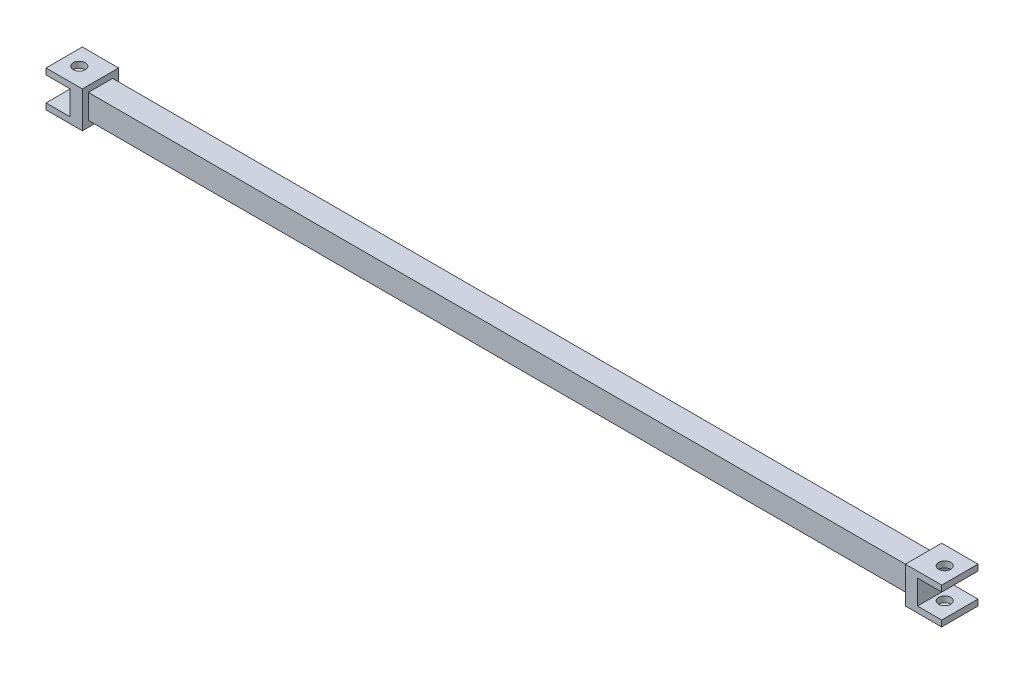
ISO-10303-21;
HEADER;
FILE_DESCRIPTION(('STEP AP214'),'2;1');
FILE_NAME('part.step','',(''),(''),'','','');
FILE_SCHEMA(('AUTOMOTIVE_DESIGN { 1 0 10303 214 1 1 1 1 }'));
ENDSEC;
DATA;
#1=APPLICATION_CONTEXT('core data for automotive mechanical design processes');
#2=APPLICATION_PROTOCOL_DEFINITION('international standard','automotive_design',2000,#1);
#3=PRODUCT_CONTEXT('',#1,'mechanical');
#4=PRODUCT('Part','Part','',(#3));
#5=PRODUCT_RELATED_PRODUCT_CATEGORY('part','',(#4));
#6=PRODUCT_DEFINITION_FORMATION('','',#4);
#7=PRODUCT_DEFINITION_CONTEXT('part definition',#1,'design');
#8=PRODUCT_DEFINITION('design','',#6,#7);
#9=PRODUCT_DEFINITION_SHAPE('','',#8);
#10=(LENGTH_UNIT() NAMED_UNIT(*) SI_UNIT(.MILLI.,.METRE.));
#11=(NAMED_UNIT(*) PLANE_ANGLE_UNIT() SI_UNIT($,.RADIAN.));
#12=(NAMED_UNIT(*) SI_UNIT($,.STERADIAN.) SOLID_ANGLE_UNIT());
#13=UNCERTAINTY_MEASURE_WITH_UNIT(LENGTH_MEASURE(1.E-05),#10,'distance_accuracy_value','');
#14=(GEOMETRIC_REPRESENTATION_CONTEXT(3) GLOBAL_UNCERTAINTY_ASSIGNED_CONTEXT((#13)) GLOBAL_UNIT_ASSIGNED_CONTEXT((#10,
#11,#12)) REPRESENTATION_CONTEXT('',''));
#15=CARTESIAN_POINT('',(0.,0.,0.));
#16=DIRECTION('',(0.,0.,1.));
#17=DIRECTION('',(1.,0.,0.));
#18=AXIS2_PLACEMENT_3D('',#15,#16,#17);
#19=CARTESIAN_POINT('',(37.,-1.5,-0.5));
#20=DIRECTION('',(0.,0.,-1.));
#21=DIRECTION('',(-1.,0.,0.));
#22=AXIS2_PLACEMENT_3D('',#19,#20,#21);
#23=PLANE('',#22);
#24=DIRECTION('',(0.,-1.,0.));
#25=VECTOR('',#24,1.);
#26=CARTESIAN_POINT('',(35.,-1.5,-0.5));
#27=LINE('',#26,#25);
#28=CARTESIAN_POINT('',(35.,0.999999999999999,-0.5));
#29=VERTEX_POINT('',#28);
#30=CARTESIAN_POINT('',(35.,-1.,-0.5));
#31=VERTEX_POINT('',#30);
#32=EDGE_CURVE('E220',#29,#31,#27,.T.);
#33=ORIENTED_EDGE('',*,*,#32,.T.);
#34=DIRECTION('',(1.,0.,0.));
#35=VECTOR('',#34,1.);
#36=CARTESIAN_POINT('',(37.,-1.,-0.5));
#37=LINE('',#36,#35);
#38=CARTESIAN_POINT('',(37.,-1.,-0.5));
#39=VERTEX_POINT('',#38);
#40=EDGE_CURVE('E411',#31,#39,#37,.T.);
#41=ORIENTED_EDGE('',*,*,#40,.T.);
#42=DIRECTION('',(0.,-1.,0.));
#43=VECTOR('',#42,1.);
#44=CARTESIAN_POINT('',(37.,-1.5,-0.5));
#45=LINE('',#44,#43);
#46=CARTESIAN_POINT('',(37.,-1.5,-0.5));
#47=VERTEX_POINT('',#46);
#48=EDGE_CURVE('E232',#39,#47,#45,.T.);
#49=ORIENTED_EDGE('',*,*,#48,.T.);
#50=DIRECTION('',(-1.,0.,0.));
#51=VECTOR('',#50,1.);
#52=CARTESIAN_POINT('',(37.,-1.5,-0.5));
#53=LINE('',#52,#51);
#54=CARTESIAN_POINT('',(34.,-1.5,-0.5));
#55=VERTEX_POINT('',#54);
#56=EDGE_CURVE('E214',#47,#55,#53,.T.);
#57=ORIENTED_EDGE('',*,*,#56,.T.);
#58=DIRECTION('',(0.,-1.,0.));
#59=VECTOR('',#58,1.);
#60=CARTESIAN_POINT('',(34.,-1.5,-0.5));
#61=LINE('',#60,#59);
#62=CARTESIAN_POINT('',(34.,1.5,-0.5));
#63=VERTEX_POINT('',#62);
#64=EDGE_CURVE('E215',#63,#55,#61,.T.);
#65=ORIENTED_EDGE('',*,*,#64,.F.);
#66=DIRECTION('',(-1.,0.,0.));
#67=VECTOR('',#66,1.);
#68=CARTESIAN_POINT('',(37.,1.5,-0.5));
#69=LINE('',#68,#67);
#70=CARTESIAN_POINT('',(37.,1.5,-0.5));
#71=VERTEX_POINT('',#70);
#72=EDGE_CURVE('E241',#71,#63,#69,.T.);
#73=ORIENTED_EDGE('',*,*,#72,.F.);
#74=CARTESIAN_POINT('',(37.,1.,-0.5));
#75=VERTEX_POINT('',#74);
#76=EDGE_CURVE('E207',#71,#75,#45,.T.);
#77=ORIENTED_EDGE('',*,*,#76,.T.);
#78=DIRECTION('',(-1.,0.,0.));
#79=VECTOR('',#78,1.);
#80=CARTESIAN_POINT('',(37.,0.999999999999999,-0.5));
#81=LINE('',#80,#79);
#82=EDGE_CURVE('E55',#75,#29,#81,.T.);
#83=ORIENTED_EDGE('',*,*,#82,.T.);
#84=EDGE_LOOP('',(#33,#41,#49,#57,#65,#73,#77,#83));
#85=FACE_BOUND('',#84,.T.);
#86=ADVANCED_FACE('F38',(#85),#23,.T.);
#87=CARTESIAN_POINT('',(37.,-1.5,2.5));
#88=DIRECTION('',(0.,0.,1.));
#89=DIRECTION('',(1.,0.,0.));
#90=AXIS2_PLACEMENT_3D('',#87,#88,#89);
#91=PLANE('',#90);
#92=DIRECTION('',(0.,1.,0.));
#93=VECTOR('',#92,1.);
#94=CARTESIAN_POINT('',(37.,-1.5,2.5));
#95=LINE('',#94,#93);
#96=CARTESIAN_POINT('',(37.,-1.5,2.5));
#97=VERTEX_POINT('',#96);
#98=CARTESIAN_POINT('',(37.,-1.,2.5));
#99=VERTEX_POINT('',#98);
#100=EDGE_CURVE('E202',#97,#99,#95,.T.);
#101=ORIENTED_EDGE('',*,*,#100,.T.);
#102=DIRECTION('',(-1.,0.,0.));
#103=VECTOR('',#102,1.);
#104=CARTESIAN_POINT('',(37.,-1.,2.5));
#105=LINE('',#104,#103);
#106=CARTESIAN_POINT('',(35.,-1.,2.5));
#107=VERTEX_POINT('',#106);
#108=EDGE_CURVE('E391',#99,#107,#105,.T.);
#109=ORIENTED_EDGE('',*,*,#108,.T.);
#110=DIRECTION('',(0.,1.,0.));
#111=VECTOR('',#110,1.);
#112=CARTESIAN_POINT('',(35.,-1.5,2.5));
#113=LINE('',#112,#111);
#114=CARTESIAN_POINT('',(35.,1.,2.5));
#115=VERTEX_POINT('',#114);
#116=EDGE_CURVE('E11',#107,#115,#113,.T.);
#117=ORIENTED_EDGE('',*,*,#116,.T.);
#118=DIRECTION('',(1.,0.,0.));
#119=VECTOR('',#118,1.);
#120=CARTESIAN_POINT('',(37.,1.,2.5));
#121=LINE('',#120,#119);
#122=CARTESIAN_POINT('',(37.,1.,2.5));
#123=VERTEX_POINT('',#122);
#124=EDGE_CURVE('E179',#115,#123,#121,.T.);
#125=ORIENTED_EDGE('',*,*,#124,.T.);
#126=CARTESIAN_POINT('',(37.,1.5,2.5));
#127=VERTEX_POINT('',#126);
#128=EDGE_CURVE('E191',#123,#127,#95,.T.);
#129=ORIENTED_EDGE('',*,*,#128,.T.);
#130=DIRECTION('',(-1.,0.,0.));
#131=VECTOR('',#130,1.);
#132=CARTESIAN_POINT('',(37.,1.5,2.5));
#133=LINE('',#132,#131);
#134=CARTESIAN_POINT('',(34.,1.5,2.5));
#135=VERTEX_POINT('',#134);
#136=EDGE_CURVE('E238',#127,#135,#133,.T.);
#137=ORIENTED_EDGE('',*,*,#136,.T.);
#138=DIRECTION('',(0.,1.,0.));
#139=VECTOR('',#138,1.);
#140=CARTESIAN_POINT('',(34.,-1.5,2.5));
#141=LINE('',#140,#139);
#142=CARTESIAN_POINT('',(34.,-1.5,2.5));
#143=VERTEX_POINT('',#142);
#144=EDGE_CURVE('E224',#143,#135,#141,.T.);
#145=ORIENTED_EDGE('',*,*,#144,.F.);
#146=DIRECTION('',(-1.,0.,0.));
#147=VECTOR('',#146,1.);
#148=CARTESIAN_POINT('',(37.,-1.5,2.5));
#149=LINE('',#148,#147);
#150=EDGE_CURVE('E235',#97,#143,#149,.T.);
#151=ORIENTED_EDGE('',*,*,#150,.F.);
#152=EDGE_LOOP('',(#101,#109,#117,#125,#129,#137,#145,#151));
#153=FACE_BOUND('',#152,.T.);
#154=ADVANCED_FACE('F190',(#153),#91,.T.);
#155=CARTESIAN_POINT('',(37.,0.,0.));
#156=DIRECTION('',(1.,0.,0.));
#157=DIRECTION('',(0.,0.,1.));
#158=AXIS2_PLACEMENT_3D('',#155,#156,#157);
#159=PLANE('',#158);
#160=ORIENTED_EDGE('',*,*,#48,.F.);
#161=DIRECTION('',(0.,0.,1.));
#162=VECTOR('',#161,1.);
#163=CARTESIAN_POINT('',(37.,-1.,0.));
#164=LINE('',#163,#162);
#165=EDGE_CURVE('E48',#39,#99,#164,.T.);
#166=ORIENTED_EDGE('',*,*,#165,.T.);
#167=ORIENTED_EDGE('',*,*,#100,.F.);
#168=DIRECTION('',(0.,0.,1.));
#169=VECTOR('',#168,1.);
#170=CARTESIAN_POINT('',(37.,-1.5,2.5));
#171=LINE('',#170,#169);
#172=EDGE_CURVE('E206',#47,#97,#171,.T.);
#173=ORIENTED_EDGE('',*,*,#172,.F.);
#174=EDGE_LOOP('',(#160,#166,#167,#173));
#175=FACE_BOUND('',#174,.T.);
#176=ADVANCED_FACE('F387',(#175),#159,.T.);
#177=ORIENTED_EDGE('',*,*,#128,.F.);
#178=DIRECTION('',(0.,0.,-1.));
#179=VECTOR('',#178,1.);
#180=CARTESIAN_POINT('',(37.,0.999999999999999,0.));
#181=LINE('',#180,#179);
#182=EDGE_CURVE('E176',#123,#75,#181,.T.);
#183=ORIENTED_EDGE('',*,*,#182,.T.);
#184=ORIENTED_EDGE('',*,*,#76,.F.);
#185=DIRECTION('',(0.,0.,-1.));
#186=VECTOR('',#185,1.);
#187=CARTESIAN_POINT('',(37.,1.5,2.5));
#188=LINE('',#187,#186);
#189=EDGE_CURVE('E200',#127,#71,#188,.T.);
#190=ORIENTED_EDGE('',*,*,#189,.F.);
#191=EDGE_LOOP('',(#177,#183,#184,#190));
#192=FACE_BOUND('',#191,.T.);
#193=ADVANCED_FACE('F198',(#192),#159,.T.);
#194=CARTESIAN_POINT('',(-37.,0.,0.));
#195=DIRECTION('',(-1.,0.,0.));
#196=DIRECTION('',(0.,0.,1.));
#197=AXIS2_PLACEMENT_3D('',#194,#195,#196);
#198=PLANE('',#197);
#199=DIRECTION('',(0.,0.,-1.));
#200=VECTOR('',#199,1.);
#201=CARTESIAN_POINT('',(-37.,0.999999999999999,0.));
#202=LINE('',#201,#200);
#203=CARTESIAN_POINT('',(-37.,1.,2.5));
#204=VERTEX_POINT('',#203);
#205=CARTESIAN_POINT('',(-37.,0.999999999999999,-0.5));
#206=VERTEX_POINT('',#205);
#207=EDGE_CURVE('E374',#204,#206,#202,.T.);
#208=ORIENTED_EDGE('',*,*,#207,.F.);
#209=DIRECTION('',(0.,1.,0.));
#210=VECTOR('',#209,1.);
#211=CARTESIAN_POINT('',(-37.,-1.5,2.5));
#212=LINE('',#211,#210);
#213=CARTESIAN_POINT('',(-37.,1.5,2.5));
#214=VERTEX_POINT('',#213);
#215=EDGE_CURVE('E291',#204,#214,#212,.T.);
#216=ORIENTED_EDGE('',*,*,#215,.T.);
#217=DIRECTION('',(0.,0.,-1.));
#218=VECTOR('',#217,1.);
#219=CARTESIAN_POINT('',(-37.,1.5,2.5));
#220=LINE('',#219,#218);
#221=CARTESIAN_POINT('',(-37.,1.5,-0.5));
#222=VERTEX_POINT('',#221);
#223=EDGE_CURVE('E296',#214,#222,#220,.T.);
#224=ORIENTED_EDGE('',*,*,#223,.T.);
#225=DIRECTION('',(0.,-1.,0.));
#226=VECTOR('',#225,1.);
#227=CARTESIAN_POINT('',(-37.,-1.5,-0.5));
#228=LINE('',#227,#226);
#229=EDGE_CURVE('E283',#222,#206,#228,.T.);
#230=ORIENTED_EDGE('',*,*,#229,.T.);
#231=EDGE_LOOP('',(#208,#216,#224,#230));
#232=FACE_BOUND('',#231,.T.);
#233=ADVANCED_FACE('F486',(#232),#198,.T.);
#234=CARTESIAN_POINT('',(-34.,1.,2.));
#235=DIRECTION('',(0.,-1.,0.));
#236=DIRECTION('',(0.,0.,-1.));
#237=AXIS2_PLACEMENT_3D('',#234,#235,#236);
#238=PLANE('',#237);
#239=DIRECTION('',(-1.,0.,0.));
#240=VECTOR('',#239,1.);
#241=CARTESIAN_POINT('',(-34.,1.,0.));
#242=LINE('',#241,#240);
#243=CARTESIAN_POINT('',(34.,1.,0.));
#244=VERTEX_POINT('',#243);
#245=CARTESIAN_POINT('',(-34.,1.,0.));
#246=VERTEX_POINT('',#245);
#247=EDGE_CURVE('E346',#244,#246,#242,.T.);
#248=ORIENTED_EDGE('',*,*,#247,.T.);
#249=DIRECTION('',(0.,0.,-1.));
#250=VECTOR('',#249,1.);
#251=CARTESIAN_POINT('',(-34.,1.,2.));
#252=LINE('',#251,#250);
#253=CARTESIAN_POINT('',(-34.,1.,2.));
#254=VERTEX_POINT('',#253);
#255=EDGE_CURVE('E363',#254,#246,#252,.T.);
#256=ORIENTED_EDGE('',*,*,#255,.F.);
#257=DIRECTION('',(-1.,0.,0.));
#258=VECTOR('',#257,1.);
#259=CARTESIAN_POINT('',(-34.,1.,2.));
#260=LINE('',#259,#258);
#261=CARTESIAN_POINT('',(34.,1.,2.));
#262=VERTEX_POINT('',#261);
#263=EDGE_CURVE('E332',#262,#254,#260,.T.);
#264=ORIENTED_EDGE('',*,*,#263,.F.);
#265=DIRECTION('',(0.,0.,-1.));
#266=VECTOR('',#265,1.);
#267=CARTESIAN_POINT('',(34.,1.,2.));
#268=LINE('',#267,#266);
#269=EDGE_CURVE('E367',#262,#244,#268,.T.);
#270=ORIENTED_EDGE('',*,*,#269,.T.);
#271=EDGE_LOOP('',(#248,#256,#264,#270));
#272=FACE_BOUND('',#271,.T.);
#273=ADVANCED_FACE('F40',(#272),#238,.F.);
#274=CARTESIAN_POINT('',(-34.,-1.,2.));
#275=DIRECTION('',(0.,1.,0.));
#276=DIRECTION('',(0.,0.,1.));
#277=AXIS2_PLACEMENT_3D('',#274,#275,#276);
#278=PLANE('',#277);
#279=DIRECTION('',(1.,0.,0.));
#280=VECTOR('',#279,1.);
#281=CARTESIAN_POINT('',(-34.,-1.,0.));
#282=LINE('',#281,#280);
#283=CARTESIAN_POINT('',(-34.,-1.,0.));
#284=VERTEX_POINT('',#283);
#285=CARTESIAN_POINT('',(34.,-1.,0.));
#286=VERTEX_POINT('',#285);
#287=EDGE_CURVE('E333',#284,#286,#282,.T.);
#288=ORIENTED_EDGE('',*,*,#287,.T.);
#289=DIRECTION('',(0.,0.,-1.));
#290=VECTOR('',#289,1.);
#291=CARTESIAN_POINT('',(34.,-1.,2.));
#292=LINE('',#291,#290);
#293=CARTESIAN_POINT('',(34.,-1.,2.));
#294=VERTEX_POINT('',#293);
#295=EDGE_CURVE('E342',#294,#286,#292,.T.);
#296=ORIENTED_EDGE('',*,*,#295,.F.);
#297=DIRECTION('',(1.,0.,0.));
#298=VECTOR('',#297,1.);
#299=CARTESIAN_POINT('',(-34.,-1.,2.));
#300=LINE('',#299,#298);
#301=CARTESIAN_POINT('',(-34.,-1.,2.));
#302=VERTEX_POINT('',#301);
#303=EDGE_CURVE('E339',#302,#294,#300,.T.);
#304=ORIENTED_EDGE('',*,*,#303,.F.);
#305=DIRECTION('',(0.,0.,-1.));
#306=VECTOR('',#305,1.);
#307=CARTESIAN_POINT('',(-34.,-1.,2.));
#308=LINE('',#307,#306);
#309=EDGE_CURVE('E360',#302,#284,#308,.T.);
#310=ORIENTED_EDGE('',*,*,#309,.T.);
#311=EDGE_LOOP('',(#288,#296,#304,#310));
#312=FACE_BOUND('',#311,.T.);
#313=ADVANCED_FACE('F510',(#312),#278,.F.);
#314=CARTESIAN_POINT('',(0.,0.,2.));
#315=DIRECTION('',(0.,0.,1.));
#316=DIRECTION('',(1.,0.,0.));
#317=AXIS2_PLACEMENT_3D('',#314,#315,#316);
#318=PLANE('',#317);
#319=DIRECTION('',(0.,1.,0.));
#320=VECTOR('',#319,1.);
#321=CARTESIAN_POINT('',(34.,1.,2.));
#322=LINE('',#321,#320);
#323=EDGE_CURVE('E328',#294,#262,#322,.T.);
#324=ORIENTED_EDGE('',*,*,#323,.T.);
#325=ORIENTED_EDGE('',*,*,#263,.T.);
#326=DIRECTION('',(0.,-1.,0.));
#327=VECTOR('',#326,1.);
#328=CARTESIAN_POINT('',(-34.,1.,2.));
#329=LINE('',#328,#327);
#330=EDGE_CURVE('E336',#254,#302,#329,.T.);
#331=ORIENTED_EDGE('',*,*,#330,.T.);
#332=ORIENTED_EDGE('',*,*,#303,.T.);
#333=EDGE_LOOP('',(#324,#325,#331,#332));
#334=FACE_BOUND('',#333,.T.);
#335=ADVANCED_FACE('F507',(#334),#318,.T.);
#336=CARTESIAN_POINT('',(0.,0.,0.));
#337=DIRECTION('',(0.,0.,1.));
#338=DIRECTION('',(1.,0.,0.));
#339=AXIS2_PLACEMENT_3D('',#336,#337,#338);
#340=PLANE('',#339);
#341=DIRECTION('',(0.,1.,0.));
#342=VECTOR('',#341,1.);
#343=CARTESIAN_POINT('',(34.,1.,0.));
#344=LINE('',#343,#342);
#345=EDGE_CURVE('E327',#286,#244,#344,.T.);
#346=ORIENTED_EDGE('',*,*,#345,.F.);
#347=ORIENTED_EDGE('',*,*,#287,.F.);
#348=DIRECTION('',(0.,-1.,0.));
#349=VECTOR('',#348,1.);
#350=CARTESIAN_POINT('',(-34.,1.,0.));
#351=LINE('',#350,#349);
#352=EDGE_CURVE('E350',#246,#284,#351,.T.);
#353=ORIENTED_EDGE('',*,*,#352,.F.);
#354=ORIENTED_EDGE('',*,*,#247,.F.);
#355=EDGE_LOOP('',(#346,#347,#353,#354));
#356=FACE_BOUND('',#355,.T.);
#357=ADVANCED_FACE('F491',(#356),#340,.F.);
#358=CARTESIAN_POINT('',(-34.,0.,0.));
#359=DIRECTION('',(-1.,0.,0.));
#360=DIRECTION('',(0.,0.,1.));
#361=AXIS2_PLACEMENT_3D('',#358,#359,#360);
#362=PLANE('',#361);
#363=DIRECTION('',(0.,-1.,0.));
#364=VECTOR('',#363,1.);
#365=CARTESIAN_POINT('',(-34.,-1.5,-0.5));
#366=LINE('',#365,#364);
#367=CARTESIAN_POINT('',(-34.,1.5,-0.5));
#368=VERTEX_POINT('',#367);
#369=CARTESIAN_POINT('',(-34.,-1.5,-0.5));
#370=VERTEX_POINT('',#369);
#371=EDGE_CURVE('E282',#368,#370,#366,.T.);
#372=ORIENTED_EDGE('',*,*,#371,.F.);
#373=DIRECTION('',(0.,0.,-1.));
#374=VECTOR('',#373,1.);
#375=CARTESIAN_POINT('',(-34.,1.5,2.5));
#376=LINE('',#375,#374);
#377=CARTESIAN_POINT('',(-34.,1.5,2.5));
#378=VERTEX_POINT('',#377);
#379=EDGE_CURVE('E309',#378,#368,#376,.T.);
#380=ORIENTED_EDGE('',*,*,#379,.F.);
#381=DIRECTION('',(0.,1.,0.));
#382=VECTOR('',#381,1.);
#383=CARTESIAN_POINT('',(-34.,-1.5,2.5));
#384=LINE('',#383,#382);
#385=CARTESIAN_POINT('',(-34.,-1.5,2.5));
#386=VERTEX_POINT('',#385);
#387=EDGE_CURVE('E306',#386,#378,#384,.T.);
#388=ORIENTED_EDGE('',*,*,#387,.F.);
#389=DIRECTION('',(0.,0.,1.));
#390=VECTOR('',#389,1.);
#391=CARTESIAN_POINT('',(-34.,-1.5,2.5));
#392=LINE('',#391,#390);
#393=EDGE_CURVE('E303',#370,#386,#392,.T.);
#394=ORIENTED_EDGE('',*,*,#393,.F.);
#395=EDGE_LOOP('',(#372,#380,#388,#394));
#396=FACE_BOUND('',#395,.T.);
#397=ORIENTED_EDGE('',*,*,#255,.T.);
#398=ORIENTED_EDGE('',*,*,#352,.T.);
#399=ORIENTED_EDGE('',*,*,#309,.F.);
#400=ORIENTED_EDGE('',*,*,#330,.F.);
#401=EDGE_LOOP('',(#397,#398,#399,#400));
#402=FACE_BOUND('',#401,.T.);
#403=ADVANCED_FACE('F487',(#396,#402),#362,.F.);
#404=CARTESIAN_POINT('',(-37.,-1.5,-0.5));
#405=DIRECTION('',(0.,0.,1.));
#406=DIRECTION('',(1.,0.,0.));
#407=AXIS2_PLACEMENT_3D('',#404,#405,#406);
#408=PLANE('',#407);
#409=DIRECTION('',(0.,-1.,0.));
#410=VECTOR('',#409,1.);
#411=CARTESIAN_POINT('',(-35.,-1.5,-0.5));
#412=LINE('',#411,#410);
#413=CARTESIAN_POINT('',(-35.,0.999999999999999,-0.5));
#414=VERTEX_POINT('',#413);
#415=CARTESIAN_POINT('',(-35.,-1.,-0.5));
#416=VERTEX_POINT('',#415);
#417=EDGE_CURVE('E279',#414,#416,#412,.T.);
#418=ORIENTED_EDGE('',*,*,#417,.F.);
#419=DIRECTION('',(-1.,0.,0.));
#420=VECTOR('',#419,1.);
#421=CARTESIAN_POINT('',(-37.,0.999999999999999,-0.5));
#422=LINE('',#421,#420);
#423=EDGE_CURVE('E275',#414,#206,#422,.T.);
#424=ORIENTED_EDGE('',*,*,#423,.T.);
#425=ORIENTED_EDGE('',*,*,#229,.F.);
#426=DIRECTION('',(1.,0.,0.));
#427=VECTOR('',#426,1.);
#428=CARTESIAN_POINT('',(-37.,1.5,-0.5));
#429=LINE('',#428,#427);
#430=EDGE_CURVE('E299',#222,#368,#429,.T.);
#431=ORIENTED_EDGE('',*,*,#430,.T.);
#432=ORIENTED_EDGE('',*,*,#371,.T.);
#433=DIRECTION('',(1.,0.,0.));
#434=VECTOR('',#433,1.);
#435=CARTESIAN_POINT('',(-37.,-1.5,-0.5));
#436=LINE('',#435,#434);
#437=CARTESIAN_POINT('',(-37.,-1.5,-0.5));
#438=VERTEX_POINT('',#437);
#439=EDGE_CURVE('E323',#438,#370,#436,.T.);
#440=ORIENTED_EDGE('',*,*,#439,.F.);
#441=CARTESIAN_POINT('',(-37.,-1.,-0.5));
#442=VERTEX_POINT('',#441);
#443=EDGE_CURVE('E288',#442,#438,#228,.T.);
#444=ORIENTED_EDGE('',*,*,#443,.F.);
#445=DIRECTION('',(1.,0.,0.));
#446=VECTOR('',#445,1.);
#447=CARTESIAN_POINT('',(-37.,-1.,-0.5));
#448=LINE('',#447,#446);
#449=EDGE_CURVE('E63',#442,#416,#448,.T.);
#450=ORIENTED_EDGE('',*,*,#449,.T.);
#451=EDGE_LOOP('',(#418,#424,#425,#431,#432,#440,#444,#450));
#452=FACE_BOUND('',#451,.T.);
#453=ADVANCED_FACE('F490',(#452),#408,.F.);
#454=CARTESIAN_POINT('',(-37.,-1.5,2.5));
#455=DIRECTION('',(0.,1.,0.));
#456=DIRECTION('',(0.,0.,1.));
#457=AXIS2_PLACEMENT_3D('',#454,#455,#456);
#458=PLANE('',#457);
#459=CARTESIAN_POINT('',(-35.75,-1.5,1.));
#460=DIRECTION('',(0.,-1.,0.));
#461=DIRECTION('',(0.,0.,-1.));
#462=AXIS2_PLACEMENT_3D('',#459,#460,#461);
#463=CIRCLE('',#462,0.499999999999999);
#464=CARTESIAN_POINT('',(-35.75,-1.5,0.500000000000001));
#465=VERTEX_POINT('',#464);
#466=EDGE_CURVE('E244',#465,#465,#463,.T.);
#467=ORIENTED_EDGE('',*,*,#466,.F.);
#468=EDGE_LOOP('',(#467));
#469=FACE_BOUND('',#468,.T.);
#470=ORIENTED_EDGE('',*,*,#393,.T.);
#471=DIRECTION('',(1.,0.,0.));
#472=VECTOR('',#471,1.);
#473=CARTESIAN_POINT('',(-37.,-1.5,2.5));
#474=LINE('',#473,#472);
#475=CARTESIAN_POINT('',(-37.,-1.5,2.5));
#476=VERTEX_POINT('',#475);
#477=EDGE_CURVE('E319',#476,#386,#474,.T.);
#478=ORIENTED_EDGE('',*,*,#477,.F.);
#479=DIRECTION('',(0.,0.,1.));
#480=VECTOR('',#479,1.);
#481=CARTESIAN_POINT('',(-37.,-1.5,2.5));
#482=LINE('',#481,#480);
#483=EDGE_CURVE('E287',#438,#476,#482,.T.);
#484=ORIENTED_EDGE('',*,*,#483,.F.);
#485=ORIENTED_EDGE('',*,*,#439,.T.);
#486=EDGE_LOOP('',(#470,#478,#484,#485));
#487=FACE_BOUND('',#486,.T.);
#488=ADVANCED_FACE('F499',(#469,#487),#458,.F.);
#489=CARTESIAN_POINT('',(-37.,-1.5,2.5));
#490=DIRECTION('',(0.,0.,-1.));
#491=DIRECTION('',(-1.,0.,0.));
#492=AXIS2_PLACEMENT_3D('',#489,#490,#491);
#493=PLANE('',#492);
#494=ORIENTED_EDGE('',*,*,#215,.F.);
#495=DIRECTION('',(1.,0.,0.));
#496=VECTOR('',#495,1.);
#497=CARTESIAN_POINT('',(-37.,1.,2.5));
#498=LINE('',#497,#496);
#499=CARTESIAN_POINT('',(-35.,1.,2.5));
#500=VERTEX_POINT('',#499);
#501=EDGE_CURVE('E271',#204,#500,#498,.T.);
#502=ORIENTED_EDGE('',*,*,#501,.T.);
#503=DIRECTION('',(0.,1.,0.));
#504=VECTOR('',#503,1.);
#505=CARTESIAN_POINT('',(-35.,-1.5,2.5));
#506=LINE('',#505,#504);
#507=CARTESIAN_POINT('',(-35.,-1.,2.5));
#508=VERTEX_POINT('',#507);
#509=EDGE_CURVE('E186',#508,#500,#506,.T.);
#510=ORIENTED_EDGE('',*,*,#509,.F.);
#511=DIRECTION('',(-1.,0.,0.));
#512=VECTOR('',#511,1.);
#513=CARTESIAN_POINT('',(-37.,-1.,2.5));
#514=LINE('',#513,#512);
#515=CARTESIAN_POINT('',(-37.,-1.,2.5));
#516=VERTEX_POINT('',#515);
#517=EDGE_CURVE('E265',#508,#516,#514,.T.);
#518=ORIENTED_EDGE('',*,*,#517,.T.);
#519=EDGE_CURVE('E292',#476,#516,#212,.T.);
#520=ORIENTED_EDGE('',*,*,#519,.F.);
#521=ORIENTED_EDGE('',*,*,#477,.T.);
#522=ORIENTED_EDGE('',*,*,#387,.T.);
#523=DIRECTION('',(1.,0.,0.));
#524=VECTOR('',#523,1.);
#525=CARTESIAN_POINT('',(-37.,1.5,2.5));
#526=LINE('',#525,#524);
#527=EDGE_CURVE('E315',#214,#378,#526,.T.);
#528=ORIENTED_EDGE('',*,*,#527,.F.);
#529=EDGE_LOOP('',(#494,#502,#510,#518,#520,#521,#522,#528));
#530=FACE_BOUND('',#529,.T.);
#531=ADVANCED_FACE('F495',(#530),#493,.F.);
#532=CARTESIAN_POINT('',(-37.,1.5,2.5));
#533=DIRECTION('',(0.,-1.,0.));
#534=DIRECTION('',(0.,0.,-1.));
#535=AXIS2_PLACEMENT_3D('',#532,#533,#534);
#536=PLANE('',#535);
#537=CARTESIAN_POINT('',(-35.75,1.5,1.));
#538=DIRECTION('',(0.,-1.,0.));
#539=DIRECTION('',(0.,0.,-1.));
#540=AXIS2_PLACEMENT_3D('',#537,#538,#539);
#541=CIRCLE('',#540,0.499999999999999);
#542=CARTESIAN_POINT('',(-35.75,1.5,0.500000000000001));
#543=VERTEX_POINT('',#542);
#544=EDGE_CURVE('E253',#543,#543,#541,.T.);
#545=ORIENTED_EDGE('',*,*,#544,.T.);
#546=EDGE_LOOP('',(#545));
#547=FACE_BOUND('',#546,.T.);
#548=ORIENTED_EDGE('',*,*,#379,.T.);
#549=ORIENTED_EDGE('',*,*,#430,.F.);
#550=ORIENTED_EDGE('',*,*,#223,.F.);
#551=ORIENTED_EDGE('',*,*,#527,.T.);
#552=EDGE_LOOP('',(#548,#549,#550,#551));
#553=FACE_BOUND('',#552,.T.);
#554=ADVANCED_FACE('F484',(#547,#553),#536,.F.);
#555=DIRECTION('',(0.,0.,1.));
#556=VECTOR('',#555,1.);
#557=CARTESIAN_POINT('',(-37.,-1.,0.));
#558=LINE('',#557,#556);
#559=EDGE_CURVE('E371',#442,#516,#558,.T.);
#560=ORIENTED_EDGE('',*,*,#559,.F.);
#561=ORIENTED_EDGE('',*,*,#443,.T.);
#562=ORIENTED_EDGE('',*,*,#483,.T.);
#563=ORIENTED_EDGE('',*,*,#519,.T.);
#564=EDGE_LOOP('',(#560,#561,#562,#563));
#565=FACE_BOUND('',#564,.T.);
#566=ADVANCED_FACE('F473',(#565),#198,.T.);
#567=CARTESIAN_POINT('',(-35.,0.,0.));
#568=DIRECTION('',(-1.,0.,0.));
#569=DIRECTION('',(0.,0.,1.));
#570=AXIS2_PLACEMENT_3D('',#567,#568,#569);
#571=PLANE('',#570);
#572=ORIENTED_EDGE('',*,*,#417,.T.);
#573=DIRECTION('',(0.,0.,1.));
#574=VECTOR('',#573,1.);
#575=CARTESIAN_POINT('',(-35.,-1.,3.24582684627362));
#576=LINE('',#575,#574);
#577=EDGE_CURVE('E257',#416,#508,#576,.T.);
#578=ORIENTED_EDGE('',*,*,#577,.T.);
#579=ORIENTED_EDGE('',*,*,#509,.T.);
#580=DIRECTION('',(0.,0.,-1.));
#581=VECTOR('',#580,1.);
#582=CARTESIAN_POINT('',(-35.,1.,3.24582684627362));
#583=LINE('',#582,#581);
#584=EDGE_CURVE('E261',#500,#414,#583,.T.);
#585=ORIENTED_EDGE('',*,*,#584,.T.);
#586=EDGE_LOOP('',(#572,#578,#579,#585));
#587=FACE_BOUND('',#586,.T.);
#588=ADVANCED_FACE('F469',(#587),#571,.T.);
#589=CARTESIAN_POINT('',(-35.,1.,3.24582684627362));
#590=DIRECTION('',(0.,1.,0.));
#591=DIRECTION('',(0.,0.,1.));
#592=AXIS2_PLACEMENT_3D('',#589,#590,#591);
#593=PLANE('',#592);
#594=CARTESIAN_POINT('',(-35.75,1.,1.));
#595=DIRECTION('',(0.,1.,0.));
#596=DIRECTION('',(0.,0.,1.));
#597=AXIS2_PLACEMENT_3D('',#594,#595,#596);
#598=CIRCLE('',#597,0.499999999999999);
#599=CARTESIAN_POINT('',(-35.75,1.,1.5));
#600=VERTEX_POINT('',#599);
#601=EDGE_CURVE('E249',#600,#600,#598,.T.);
#602=ORIENTED_EDGE('',*,*,#601,.T.);
#603=EDGE_LOOP('',(#602));
#604=FACE_BOUND('',#603,.T.);
#605=ORIENTED_EDGE('',*,*,#584,.F.);
#606=ORIENTED_EDGE('',*,*,#501,.F.);
#607=ORIENTED_EDGE('',*,*,#207,.T.);
#608=ORIENTED_EDGE('',*,*,#423,.F.);
#609=EDGE_LOOP('',(#605,#606,#607,#608));
#610=FACE_BOUND('',#609,.T.);
#611=ADVANCED_FACE('F472',(#604,#610),#593,.F.);
#612=CARTESIAN_POINT('',(-35.,-1.,3.24582684627362));
#613=DIRECTION('',(0.,-1.,0.));
#614=DIRECTION('',(0.,0.,-1.));
#615=AXIS2_PLACEMENT_3D('',#612,#613,#614);
#616=PLANE('',#615);
#617=CARTESIAN_POINT('',(-35.75,-1.,1.));
#618=DIRECTION('',(0.,-1.,0.));
#619=DIRECTION('',(0.,0.,-1.));
#620=AXIS2_PLACEMENT_3D('',#617,#618,#619);
#621=CIRCLE('',#620,0.499999999999999);
#622=CARTESIAN_POINT('',(-35.75,-1.,0.500000000000001));
#623=VERTEX_POINT('',#622);
#624=EDGE_CURVE('E248',#623,#623,#621,.T.);
#625=ORIENTED_EDGE('',*,*,#624,.T.);
#626=EDGE_LOOP('',(#625));
#627=FACE_BOUND('',#626,.T.);
#628=ORIENTED_EDGE('',*,*,#559,.T.);
#629=ORIENTED_EDGE('',*,*,#517,.F.);
#630=ORIENTED_EDGE('',*,*,#577,.F.);
#631=ORIENTED_EDGE('',*,*,#449,.F.);
#632=EDGE_LOOP('',(#628,#629,#630,#631));
#633=FACE_BOUND('',#632,.T.);
#634=ADVANCED_FACE('F477',(#627,#633),#616,.F.);
#635=CARTESIAN_POINT('',(-35.75,2.5,1.));
#636=DIRECTION('',(0.,-1.,0.));
#637=DIRECTION('',(0.,0.,-1.));
#638=AXIS2_PLACEMENT_3D('',#635,#636,#637);
#639=CYLINDRICAL_SURFACE('',#638,0.499999999999999);
#640=ORIENTED_EDGE('',*,*,#466,.T.);
#641=EDGE_LOOP('',(#640));
#642=FACE_BOUND('',#641,.T.);
#643=ORIENTED_EDGE('',*,*,#624,.F.);
#644=EDGE_LOOP('',(#643));
#645=FACE_BOUND('',#644,.T.);
#646=ADVANCED_FACE('F467',(#642,#645),#639,.F.);
#647=ORIENTED_EDGE('',*,*,#601,.F.);
#648=EDGE_LOOP('',(#647));
#649=FACE_BOUND('',#648,.T.);
#650=ORIENTED_EDGE('',*,*,#544,.F.);
#651=EDGE_LOOP('',(#650));
#652=FACE_BOUND('',#651,.T.);
#653=ADVANCED_FACE('F464',(#649,#652),#639,.F.);
#654=CARTESIAN_POINT('',(34.,0.,0.));
#655=DIRECTION('',(1.,0.,0.));
#656=DIRECTION('',(0.,0.,1.));
#657=AXIS2_PLACEMENT_3D('',#654,#655,#656);
#658=PLANE('',#657);
#659=ORIENTED_EDGE('',*,*,#64,.T.);
#660=DIRECTION('',(0.,0.,1.));
#661=VECTOR('',#660,1.);
#662=CARTESIAN_POINT('',(34.,-1.5,2.5));
#663=LINE('',#662,#661);
#664=EDGE_CURVE('E228',#55,#143,#663,.T.);
#665=ORIENTED_EDGE('',*,*,#664,.T.);
#666=ORIENTED_EDGE('',*,*,#144,.T.);
#667=DIRECTION('',(0.,0.,-1.));
#668=VECTOR('',#667,1.);
#669=CARTESIAN_POINT('',(34.,1.5,2.5));
#670=LINE('',#669,#668);
#671=EDGE_CURVE('E219',#135,#63,#670,.T.);
#672=ORIENTED_EDGE('',*,*,#671,.T.);
#673=EDGE_LOOP('',(#659,#665,#666,#672));
#674=FACE_BOUND('',#673,.T.);
#675=ORIENTED_EDGE('',*,*,#295,.T.);
#676=ORIENTED_EDGE('',*,*,#345,.T.);
#677=ORIENTED_EDGE('',*,*,#269,.F.);
#678=ORIENTED_EDGE('',*,*,#323,.F.);
#679=EDGE_LOOP('',(#675,#676,#677,#678));
#680=FACE_BOUND('',#679,.T.);
#681=ADVANCED_FACE('F401',(#674,#680),#658,.F.);
#682=CARTESIAN_POINT('',(37.,1.5,2.5));
#683=DIRECTION('',(0.,1.,0.));
#684=DIRECTION('',(0.,0.,1.));
#685=AXIS2_PLACEMENT_3D('',#682,#683,#684);
#686=PLANE('',#685);
#687=CARTESIAN_POINT('',(35.75,1.5,1.));
#688=DIRECTION('',(0.,1.,0.));
#689=DIRECTION('',(0.,0.,1.));
#690=AXIS2_PLACEMENT_3D('',#687,#688,#689);
#691=CIRCLE('',#690,0.499999999999999);
#692=CARTESIAN_POINT('',(35.75,1.5,1.5));
#693=VERTEX_POINT('',#692);
#694=EDGE_CURVE('E424',#693,#693,#691,.F.);
#695=ORIENTED_EDGE('',*,*,#694,.T.);
#696=EDGE_LOOP('',(#695));
#697=FACE_BOUND('',#696,.T.);
#698=ORIENTED_EDGE('',*,*,#671,.F.);
#699=ORIENTED_EDGE('',*,*,#136,.F.);
#700=ORIENTED_EDGE('',*,*,#189,.T.);
#701=ORIENTED_EDGE('',*,*,#72,.T.);
#702=EDGE_LOOP('',(#698,#699,#700,#701));
#703=FACE_BOUND('',#702,.T.);
#704=ADVANCED_FACE('F405',(#697,#703),#686,.T.);
#705=CARTESIAN_POINT('',(37.,-1.5,2.5));
#706=DIRECTION('',(0.,-1.,0.));
#707=DIRECTION('',(0.,0.,-1.));
#708=AXIS2_PLACEMENT_3D('',#705,#706,#707);
#709=PLANE('',#708);
#710=CARTESIAN_POINT('',(35.75,-1.5,1.));
#711=DIRECTION('',(0.,1.,0.));
#712=DIRECTION('',(0.,0.,-1.));
#713=AXIS2_PLACEMENT_3D('',#710,#711,#712);
#714=CIRCLE('',#713,0.499999999999999);
#715=CARTESIAN_POINT('',(35.75,-1.5,0.500000000000001));
#716=VERTEX_POINT('',#715);
#717=EDGE_CURVE('E432',#716,#716,#714,.T.);
#718=ORIENTED_EDGE('',*,*,#717,.T.);
#719=EDGE_LOOP('',(#718));
#720=FACE_BOUND('',#719,.T.);
#721=ORIENTED_EDGE('',*,*,#664,.F.);
#722=ORIENTED_EDGE('',*,*,#56,.F.);
#723=ORIENTED_EDGE('',*,*,#172,.T.);
#724=ORIENTED_EDGE('',*,*,#150,.T.);
#725=EDGE_LOOP('',(#721,#722,#723,#724));
#726=FACE_BOUND('',#725,.T.);
#727=ADVANCED_FACE('F395',(#720,#726),#709,.T.);
#728=CARTESIAN_POINT('',(35.,-1.,3.24582684627362));
#729=DIRECTION('',(0.,1.,0.));
#730=DIRECTION('',(0.,0.,1.));
#731=AXIS2_PLACEMENT_3D('',#728,#729,#730);
#732=PLANE('',#731);
#733=CARTESIAN_POINT('',(35.75,-1.,1.));
#734=DIRECTION('',(0.,1.,0.));
#735=DIRECTION('',(0.,0.,1.));
#736=AXIS2_PLACEMENT_3D('',#733,#734,#735);
#737=CIRCLE('',#736,0.499999999999999);
#738=CARTESIAN_POINT('',(35.75,-1.,1.5));
#739=VERTEX_POINT('',#738);
#740=EDGE_CURVE('E428',#739,#739,#737,.F.);
#741=ORIENTED_EDGE('',*,*,#740,.T.);
#742=EDGE_LOOP('',(#741));
#743=FACE_BOUND('',#742,.T.);
#744=DIRECTION('',(0.,0.,1.));
#745=VECTOR('',#744,1.);
#746=CARTESIAN_POINT('',(35.,-1.,3.24582684627362));
#747=LINE('',#746,#745);
#748=EDGE_CURVE('E195',#31,#107,#747,.T.);
#749=ORIENTED_EDGE('',*,*,#748,.T.);
#750=ORIENTED_EDGE('',*,*,#108,.F.);
#751=ORIENTED_EDGE('',*,*,#165,.F.);
#752=ORIENTED_EDGE('',*,*,#40,.F.);
#753=EDGE_LOOP('',(#749,#750,#751,#752));
#754=FACE_BOUND('',#753,.T.);
#755=ADVANCED_FACE('F539',(#743,#754),#732,.T.);
#756=CARTESIAN_POINT('',(35.,1.,3.24582684627362));
#757=DIRECTION('',(0.,-1.,0.));
#758=DIRECTION('',(0.,0.,-1.));
#759=AXIS2_PLACEMENT_3D('',#756,#757,#758);
#760=PLANE('',#759);
#761=CARTESIAN_POINT('',(35.75,1.,1.));
#762=DIRECTION('',(0.,-1.,0.));
#763=DIRECTION('',(0.,0.,-1.));
#764=AXIS2_PLACEMENT_3D('',#761,#762,#763);
#765=CIRCLE('',#764,0.499999999999999);
#766=CARTESIAN_POINT('',(35.75,1.,0.500000000000001));
#767=VERTEX_POINT('',#766);
#768=EDGE_CURVE('E42',#767,#767,#765,.F.);
#769=ORIENTED_EDGE('',*,*,#768,.T.);
#770=EDGE_LOOP('',(#769));
#771=FACE_BOUND('',#770,.T.);
#772=ORIENTED_EDGE('',*,*,#182,.F.);
#773=ORIENTED_EDGE('',*,*,#124,.F.);
#774=DIRECTION('',(0.,0.,-1.));
#775=VECTOR('',#774,1.);
#776=CARTESIAN_POINT('',(35.,1.,3.24582684627362));
#777=LINE('',#776,#775);
#778=EDGE_CURVE('E421',#115,#29,#777,.T.);
#779=ORIENTED_EDGE('',*,*,#778,.T.);
#780=ORIENTED_EDGE('',*,*,#82,.F.);
#781=EDGE_LOOP('',(#772,#773,#779,#780));
#782=FACE_BOUND('',#781,.T.);
#783=ADVANCED_FACE('F178',(#771,#782),#760,.T.);
#784=CARTESIAN_POINT('',(35.,0.,0.));
#785=DIRECTION('',(1.,0.,0.));
#786=DIRECTION('',(0.,0.,1.));
#787=AXIS2_PLACEMENT_3D('',#784,#785,#786);
#788=PLANE('',#787);
#789=ORIENTED_EDGE('',*,*,#778,.F.);
#790=ORIENTED_EDGE('',*,*,#116,.F.);
#791=ORIENTED_EDGE('',*,*,#748,.F.);
#792=ORIENTED_EDGE('',*,*,#32,.F.);
#793=EDGE_LOOP('',(#789,#790,#791,#792));
#794=FACE_BOUND('',#793,.T.);
#795=ADVANCED_FACE('F445',(#794),#788,.T.);
#796=CARTESIAN_POINT('',(35.75,2.5,1.));
#797=DIRECTION('',(0.,-1.,0.));
#798=DIRECTION('',(0.,0.,-1.));
#799=AXIS2_PLACEMENT_3D('',#796,#797,#798);
#800=CYLINDRICAL_SURFACE('',#799,0.499999999999999);
#801=ORIENTED_EDGE('',*,*,#694,.F.);
#802=EDGE_LOOP('',(#801));
#803=FACE_BOUND('',#802,.T.);
#804=ORIENTED_EDGE('',*,*,#768,.F.);
#805=EDGE_LOOP('',(#804));
#806=FACE_BOUND('',#805,.T.);
#807=ADVANCED_FACE('F442',(#803,#806),#800,.F.);
#808=ORIENTED_EDGE('',*,*,#740,.F.);
#809=EDGE_LOOP('',(#808));
#810=FACE_BOUND('',#809,.T.);
#811=ORIENTED_EDGE('',*,*,#717,.F.);
#812=EDGE_LOOP('',(#811));
#813=FACE_BOUND('',#812,.T.);
#814=ADVANCED_FACE('F444',(#810,#813),#800,.F.);
#815=CLOSED_SHELL('',(#86,#154,#176,#193,#233,#273,#313,#335,#357,#403,#453,#488,#531,#554,#566,
#588,#611,#634,#646,#653,#681,#704,#727,#755,#783,#795,#807,#814));
#816=MANIFOLD_SOLID_BREP('B2',#815);
#817=ADVANCED_BREP_SHAPE_REPRESENTATION('',(#18,#816),#14);
#818=SHAPE_DEFINITION_REPRESENTATION(#9,#817);
ENDSEC;
END-ISO-10303-21;
